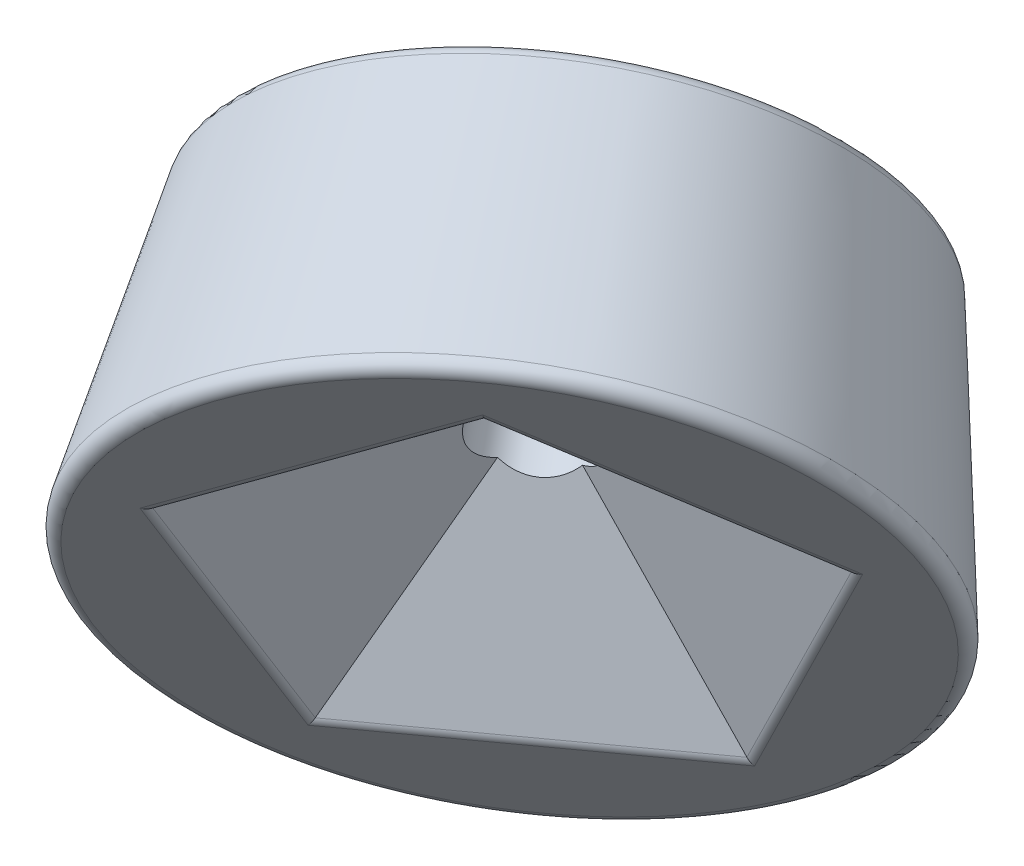
ISO-10303-21;
HEADER;
FILE_DESCRIPTION(('STEP AP214'),'2;1');
FILE_NAME('part.step','',(''),(''),'','','');
FILE_SCHEMA(('AUTOMOTIVE_DESIGN { 1 0 10303 214 1 1 1 1 }'));
ENDSEC;
DATA;
#1=APPLICATION_CONTEXT('core data for automotive mechanical design processes');
#2=APPLICATION_PROTOCOL_DEFINITION('international standard','automotive_design',2000,#1);
#3=PRODUCT_CONTEXT('',#1,'mechanical');
#4=PRODUCT('Part','Part','',(#3));
#5=PRODUCT_RELATED_PRODUCT_CATEGORY('part','',(#4));
#6=PRODUCT_DEFINITION_FORMATION('','',#4);
#7=PRODUCT_DEFINITION_CONTEXT('part definition',#1,'design');
#8=PRODUCT_DEFINITION('design','',#6,#7);
#9=PRODUCT_DEFINITION_SHAPE('','',#8);
#10=(LENGTH_UNIT() NAMED_UNIT(*) SI_UNIT(.MILLI.,.METRE.));
#11=(NAMED_UNIT(*) PLANE_ANGLE_UNIT() SI_UNIT($,.RADIAN.));
#12=(NAMED_UNIT(*) SI_UNIT($,.STERADIAN.) SOLID_ANGLE_UNIT());
#13=UNCERTAINTY_MEASURE_WITH_UNIT(LENGTH_MEASURE(1.E-05),#10,'distance_accuracy_value','');
#14=(GEOMETRIC_REPRESENTATION_CONTEXT(3) GLOBAL_UNCERTAINTY_ASSIGNED_CONTEXT((#13)) GLOBAL_UNIT_ASSIGNED_CONTEXT((#10,
#11,#12)) REPRESENTATION_CONTEXT('',''));
#15=CARTESIAN_POINT('',(0.,0.,0.));
#16=DIRECTION('',(0.,0.,1.));
#17=DIRECTION('',(1.,0.,0.));
#18=AXIS2_PLACEMENT_3D('',#15,#16,#17);
#19=CARTESIAN_POINT('',(-12.9243592330174,10.9941166289986,-17.788854382));
#20=DIRECTION('',(-0.52573111211913,0.447213595499961,-0.723606797749979));
#21=DIRECTION('',(-0.809016994374949,0.,0.587785252292471));
#22=AXIS2_PLACEMENT_3D('',#19,#20,#21);
#23=PLANE('',#22);
#24=DIRECTION('',(0.809016994374949,0.525731112119135,-0.262865556059561));
#25=VECTOR('',#24,1.);
#26=CARTESIAN_POINT('',(-16.9503146074278,22.0766210089228,-8.01446219937631));
#27=LINE('',#26,#25);
#28=CARTESIAN_POINT('',(-16.4420593360385,22.4069053056999,-8.17960434776489));
#29=VERTEX_POINT('',#28);
#30=CARTESIAN_POINT('',(-7.94800471586553,27.9266765996446,-10.9394899947371));
#31=VERTEX_POINT('',#30);
#32=EDGE_CURVE('E258',#29,#31,#27,.T.);
#33=ORIENTED_EDGE('',*,*,#32,.T.);
#34=DIRECTION('',(0.499999999999995,-0.525731112119139,-0.688190960235586));
#35=VECTOR('',#34,1.);
#36=CARTESIAN_POINT('',(-2.38427122562076,22.0766210089227,-18.5973121810301));
#37=LINE('',#36,#35);
#38=CARTESIAN_POINT('',(-2.69839025830066,22.4069053056999,-18.1649644235736));
#39=VERTEX_POINT('',#38);
#40=EDGE_CURVE('E264',#31,#39,#37,.T.);
#41=ORIENTED_EDGE('',*,*,#40,.T.);
#42=DIRECTION('',(-0.499999999999999,-0.850650808352039,-0.16245984811646));
#43=VECTOR('',#42,1.);
#44=CARTESIAN_POINT('',(-7.89885248454272,13.5593505125858,-19.8546970303949));
#45=LINE('',#44,#43);
#46=CARTESIAN_POINT('',(-7.94800471586544,13.4757277419719,-19.8706675584655));
#47=VERTEX_POINT('',#46);
#48=EDGE_CURVE('E261',#39,#47,#45,.T.);
#49=ORIENTED_EDGE('',*,*,#48,.T.);
#50=DIRECTION('',(-0.809016994374952,0.,0.587785252292467));
#51=VECTOR('',#50,1.);
#52=CARTESIAN_POINT('',(-16.3625293551352,13.4757277419717,-13.7571575550871));
#53=LINE('',#52,#51);
#54=CARTESIAN_POINT('',(-16.4420593360384,13.4757277419717,-13.6993756417095));
#55=VERTEX_POINT('',#54);
#56=EDGE_CURVE('E255',#47,#55,#53,.T.);
#57=ORIENTED_EDGE('',*,*,#56,.T.);
#58=DIRECTION('',(0.,0.850650808352036,0.52573111211914));
#59=VECTOR('',#58,1.);
#60=CARTESIAN_POINT('',(-16.4420593360385,22.3232825350859,-8.23128606223779));
#61=LINE('',#60,#59);
#62=EDGE_CURVE('E252',#55,#29,#61,.T.);
#63=ORIENTED_EDGE('',*,*,#62,.T.);
#64=EDGE_LOOP('',(#33,#41,#49,#57,#63));
#65=FACE_BOUND('',#64,.T.);
#66=CARTESIAN_POINT('',(-10.2957036724217,19.9383885389976,-14.1708203932502));
#67=DIRECTION('',(-0.52573111211913,0.447213595499961,-0.723606797749979));
#68=DIRECTION('',(-0.809016994374949,0.,0.587785252292471));
#69=AXIS2_PLACEMENT_3D('',#66,#67,#68);
#70=CIRCLE('',#69,10.5232985629623);
#71=CARTESIAN_POINT('',(-18.8092310467396,19.9383885389976,-7.98538069247037));
#72=VERTEX_POINT('',#71);
#73=EDGE_CURVE('E248',#72,#72,#70,.F.);
#74=ORIENTED_EDGE('',*,*,#73,.T.);
#75=EDGE_LOOP('',(#74));
#76=FACE_BOUND('',#75,.T.);
#77=ADVANCED_FACE('F137',(#65,#76),#23,.F.);
#78=CARTESIAN_POINT('',(-16.5993218992185,22.8470065541656,-5.39344662916647));
#79=DIRECTION('',(-0.577350269189626,0.794654472291765,-0.187592474085085));
#80=DIRECTION('',(-0.809016994374947,-0.587785252292474,0.));
#81=AXIS2_PLACEMENT_3D('',#78,#79,#80);
#82=PLANE('',#81);
#83=DIRECTION('',(-0.309016994374956,0.,0.951056516295151));
#84=VECTOR('',#83,1.);
#85=CARTESIAN_POINT('',(-13.1432778029782,22.3606797749979,-18.0901699437496));
#86=LINE('',#85,#84);
#87=CARTESIAN_POINT('',(-13.7608389517827,22.3606797749979,-16.1895121628748));
#88=VERTEX_POINT('',#87);
#89=CARTESIAN_POINT('',(-16.278682837301,22.3606797749979,-8.44038548723812));
#90=VERTEX_POINT('',#89);
#91=EDGE_CURVE('E229',#88,#90,#86,.T.);
#92=ORIENTED_EDGE('',*,*,#91,.F.);
#93=CARTESIAN_POINT('',(-13.1432778029782,22.3606797749979,-18.0901699437496));
#94=DIRECTION('',(-0.577350269189626,0.794654472291765,-0.187592474085085));
#95=DIRECTION('',(-0.11026408970826,-0.303530999103345,-0.946419971843438));
#96=AXIS2_PLACEMENT_3D('',#93,#94,#95);
#97=ELLIPSE('',#96,2.13929457302018,1.7);
#98=CARTESIAN_POINT('',(-12.144042874081,23.4113375558727,-16.7148410533122));
#99=VERTEX_POINT('',#98);
#100=EDGE_CURVE('E156',#88,#99,#97,.T.);
#101=ORIENTED_EDGE('',*,*,#100,.T.);
#102=DIRECTION('',(-0.499999999999993,-0.525731112119135,-0.68819096023559));
#103=VECTOR('',#102,1.);
#104=CARTESIAN_POINT('',(0.,36.180339887499,0.));
#105=LINE('',#104,#103);
#106=CARTESIAN_POINT('',(-8.07008588894658,27.6949494289132,-11.1075203141958));
#107=VERTEX_POINT('',#106);
#108=EDGE_CURVE('E240',#107,#99,#105,.T.);
#109=ORIENTED_EDGE('',*,*,#108,.F.);
#110=DIRECTION('',(0.809016994374949,0.525731112119135,-0.262865556059561));
#111=VECTOR('',#110,1.);
#112=CARTESIAN_POINT('',(-16.9296669445996,21.9376446582061,-8.22886792884227));
#113=LINE('',#112,#111);
#114=EDGE_CURVE('E385',#107,#90,#113,.F.);
#115=ORIENTED_EDGE('',*,*,#114,.T.);
#116=EDGE_LOOP('',(#92,#101,#109,#115));
#117=FACE_BOUND('',#116,.T.);
#118=ADVANCED_FACE('F317',(#117),#82,.F.);
#119=CARTESIAN_POINT('',(2.06681201188747E-13,22.8470065541656,-17.4535599249993));
#120=DIRECTION('',(0.,0.794654472291765,-0.607061998206687));
#121=DIRECTION('',(0.,0.607061998206687,0.794654472291765));
#122=AXIS2_PLACEMENT_3D('',#119,#120,#121);
#123=PLANE('',#122);
#124=ORIENTED_EDGE('',*,*,#108,.T.);
#125=CARTESIAN_POINT('',(-13.1432778029782,22.3606797749979,-18.0901699437496));
#126=DIRECTION('',(0.,0.794654472291765,-0.607061998206687));
#127=DIRECTION('',(-0.866025403784443,-0.303530999103335,-0.397327236145881));
#128=AXIS2_PLACEMENT_3D('',#125,#126,#127);
#129=ELLIPSE('',#128,2.13929457302019,1.7);
#130=CARTESIAN_POINT('',(-11.1448079451838,22.3606797749979,-18.0901699437496));
#131=VERTEX_POINT('',#130);
#132=EDGE_CURVE('E281',#99,#131,#129,.T.);
#133=ORIENTED_EDGE('',*,*,#132,.T.);
#134=DIRECTION('',(-1.,0.,0.));
#135=VECTOR('',#134,1.);
#136=CARTESIAN_POINT('',(13.1432778029785,22.3606797749979,-18.0901699437493));
#137=LINE('',#136,#135);
#138=CARTESIAN_POINT('',(-2.99689397491491,22.3606797749979,-18.0901699437495));
#139=VERTEX_POINT('',#138);
#140=EDGE_CURVE('E223',#139,#131,#137,.T.);
#141=ORIENTED_EDGE('',*,*,#140,.F.);
#142=DIRECTION('',(0.499999999999994,-0.525731112119139,-0.688190960235586));
#143=VECTOR('',#142,1.);
#144=CARTESIAN_POINT('',(-2.59456367046841,21.937644658206,-18.6439301008474));
#145=LINE('',#144,#143);
#146=EDGE_CURVE('E268',#139,#107,#145,.F.);
#147=ORIENTED_EDGE('',*,*,#146,.T.);
#148=EDGE_LOOP('',(#124,#133,#141,#147));
#149=FACE_BOUND('',#148,.T.);
#150=ADVANCED_FACE('F323',(#149),#123,.F.);
#151=CARTESIAN_POINT('',(2.52685582398812E-13,4.120226591666,-21.5737865166653));
#152=DIRECTION('',(0.,-0.187592474085081,0.982246946376846));
#153=DIRECTION('',(0.,-0.982246946376846,-0.187592474085081));
#154=AXIS2_PLACEMENT_3D('',#151,#152,#153);
#155=PLANE('',#154);
#156=CARTESIAN_POINT('',(-13.1432778029782,22.3606797749979,-18.0901699437497));
#157=DIRECTION('',(0.,-0.187592474085081,0.982246946376846));
#158=DIRECTION('',(-0.866025403784439,0.491123473188424,0.0937962370425304));
#159=AXIS2_PLACEMENT_3D('',#156,#157,#158);
#160=ELLIPSE('',#159,2.13929457302021,1.7);
#161=CARTESIAN_POINT('',(-12.1440428740809,20.6606797749979,-18.4148410533122));
#162=VERTEX_POINT('',#161);
#163=EDGE_CURVE('E213',#162,#131,#160,.T.);
#164=ORIENTED_EDGE('',*,*,#163,.F.);
#165=DIRECTION('',(0.500000000000002,-0.85065080835204,-0.162459848116448));
#166=VECTOR('',#165,1.);
#167=CARTESIAN_POINT('',(-13.1432778029781,22.3606797749979,-18.0901699437497));
#168=LINE('',#167,#166);
#169=CARTESIAN_POINT('',(-8.07008588894651,13.7296501698059,-19.738549919388));
#170=VERTEX_POINT('',#169);
#171=EDGE_CURVE('E141',#162,#170,#168,.T.);
#172=ORIENTED_EDGE('',*,*,#171,.T.);
#173=DIRECTION('',(-0.499999999999999,-0.850650808352039,-0.16245984811646));
#174=VECTOR('',#173,1.);
#175=CARTESIAN_POINT('',(-2.95783493447107,22.4271309836519,-18.0774788921934));
#176=LINE('',#175,#174);
#177=EDGE_CURVE('E375',#170,#139,#176,.F.);
#178=ORIENTED_EDGE('',*,*,#177,.T.);
#179=ORIENTED_EDGE('',*,*,#140,.T.);
#180=EDGE_LOOP('',(#164,#172,#178,#179));
#181=FACE_BOUND('',#180,.T.);
#182=ADVANCED_FACE('F330',(#181),#155,.T.);
#183=CARTESIAN_POINT('',(-10.2589451239174,-3.33333333333333,-14.1202265916661));
#184=DIRECTION('',(0.577350269189618,0.187592474085079,0.794654472291772));
#185=DIRECTION('',(0.809016994374953,0.,-0.587785252292465));
#186=AXIS2_PLACEMENT_3D('',#183,#184,#185);
#187=PLANE('',#186);
#188=CARTESIAN_POINT('',(-13.1432778029782,22.3606797749979,-18.0901699437496));
#189=DIRECTION('',(0.577350269189618,0.187592474085079,0.794654472291772));
#190=DIRECTION('',(-0.110264089708275,0.982246946376846,-0.151765499551666));
#191=AXIS2_PLACEMENT_3D('',#188,#189,#190);
#192=ELLIPSE('',#191,2.1392945730202,1.7);
#193=CARTESIAN_POINT('',(-13.7608389517827,20.6606797749979,-17.2401699437496));
#194=VERTEX_POINT('',#193);
#195=EDGE_CURVE('E203',#194,#162,#192,.T.);
#196=ORIENTED_EDGE('',*,*,#195,.F.);
#197=DIRECTION('',(-0.309016994374952,-0.85065080835204,0.425325404176017));
#198=VECTOR('',#197,1.);
#199=CARTESIAN_POINT('',(-13.1432778029782,22.3606797749979,-18.0901699437496));
#200=LINE('',#199,#198);
#201=CARTESIAN_POINT('',(-16.2786828373009,13.7296501698057,-13.7746551411536));
#202=VERTEX_POINT('',#201);
#203=EDGE_CURVE('E164',#194,#202,#200,.T.);
#204=ORIENTED_EDGE('',*,*,#203,.T.);
#205=DIRECTION('',(-0.809016994374952,0.,0.587785252292467));
#206=VECTOR('',#205,1.);
#207=CARTESIAN_POINT('',(-8.00688703393422,13.7296501698059,-19.7844665752757));
#208=LINE('',#207,#206);
#209=EDGE_CURVE('E148',#202,#170,#208,.F.);
#210=ORIENTED_EDGE('',*,*,#209,.T.);
#211=ORIENTED_EDGE('',*,*,#171,.F.);
#212=EDGE_LOOP('',(#196,#204,#210,#211));
#213=FACE_BOUND('',#212,.T.);
#214=ADVANCED_FACE('F211',(#213),#187,.T.);
#215=CARTESIAN_POINT('',(-20.517890247835,4.120226591666,-6.66666666666688));
#216=DIRECTION('',(0.934172358962713,-0.187592474085081,0.303530999103352));
#217=DIRECTION('',(0.309016994374956,0.,-0.951056516295151));
#218=AXIS2_PLACEMENT_3D('',#215,#216,#217);
#219=PLANE('',#218);
#220=CARTESIAN_POINT('',(-13.1432778029782,22.3606797749979,-18.0901699437496));
#221=DIRECTION('',(0.934172358962713,-0.187592474085081,0.303530999103352));
#222=DIRECTION('',(0.356822089773098,0.49112347318843,-0.794654472291758));
#223=AXIS2_PLACEMENT_3D('',#220,#221,#222);
#224=ELLIPSE('',#223,2.13929457302018,1.7);
#225=EDGE_CURVE('E201',#88,#194,#224,.T.);
#226=ORIENTED_EDGE('',*,*,#225,.F.);
#227=ORIENTED_EDGE('',*,*,#91,.T.);
#228=DIRECTION('',(0.,0.850650808352036,0.52573111211914));
#229=VECTOR('',#228,1.);
#230=CARTESIAN_POINT('',(-16.278682837301,13.6631989611517,-13.8157242466952));
#231=LINE('',#230,#229);
#232=EDGE_CURVE('E14',#90,#202,#231,.F.);
#233=ORIENTED_EDGE('',*,*,#232,.T.);
#234=ORIENTED_EDGE('',*,*,#203,.F.);
#235=EDGE_LOOP('',(#226,#227,#233,#234));
#236=FACE_BOUND('',#235,.T.);
#237=ADVANCED_FACE('F215',(#236),#219,.T.);
#238=CARTESIAN_POINT('',(-19.0211303259029,27.3606797749979,-26.1803398874991));
#239=DIRECTION('',(0.525731112119131,-0.447213595499962,0.723606797749978));
#240=DIRECTION('',(0.809016994374949,0.,-0.587785252292472));
#241=AXIS2_PLACEMENT_3D('',#238,#239,#240);
#242=CONICAL_SURFACE('',#241,8.07354557922219,0.174532925199426);
#243=CARTESIAN_POINT('',(-15.1672369960462,24.0823622986528,-20.8759107848599));
#244=DIRECTION('',(-0.525731112119131,0.447213595499962,-0.723606797749978));
#245=DIRECTION('',(-0.809016994374949,0.,0.587785252292471));
#246=AXIS2_PLACEMENT_3D('',#243,#244,#245);
#247=CIRCLE('',#246,9.36611769291537);
#248=CARTESIAN_POINT('',(-22.7445853809306,24.0823622986528,-15.3706449337286));
#249=VERTEX_POINT('',#248);
#250=EDGE_CURVE('E239',#249,#249,#247,.F.);
#251=ORIENTED_EDGE('',*,*,#250,.T.);
#252=EDGE_LOOP('',(#251));
#253=FACE_BOUND('',#252,.T.);
#254=CARTESIAN_POINT('',(-10.5425130170942,20.1483371075522,-14.5105243130609));
#255=DIRECTION('',(-0.52573111211913,0.447213595499961,-0.723606797749979));
#256=DIRECTION('',(-0.809016994374949,0.,0.587785252292471));
#257=AXIS2_PLACEMENT_3D('',#254,#255,#256);
#258=CIRCLE('',#257,10.9172216641672);
#259=CARTESIAN_POINT('',(-19.3747308747638,20.1483371075522,-8.09354242285553));
#260=VERTEX_POINT('',#259);
#261=EDGE_CURVE('E235',#260,#260,#258,.T.);
#262=ORIENTED_EDGE('',*,*,#261,.T.);
#263=EDGE_LOOP('',(#262));
#264=FACE_BOUND('',#263,.T.);
#265=ADVANCED_FACE('F296',(#253,#264),#242,.T.);
#266=CARTESIAN_POINT('',(-17.9696681016647,15.2859126964992,-24.733126291999));
#267=DIRECTION('',(0.525731112119131,-0.447213595499962,0.723606797749978));
#268=DIRECTION('',(0.809016994374949,0.,-0.587785252292471));
#269=AXIS2_PLACEMENT_3D('',#266,#267,#268);
#270=PLANE('',#269);
#271=CARTESIAN_POINT('',(-15.3410125410689,24.2301846064982,-21.1150923032492));
#272=DIRECTION('',(-0.525731112119131,0.447213595499962,-0.723606797749979));
#273=DIRECTION('',(-0.809016994374949,0.,0.587785252292471));
#274=AXIS2_PLACEMENT_3D('',#271,#272,#273);
#275=CIRCLE('',#274,1.7);
#276=CARTESIAN_POINT('',(-16.7163414315063,24.2301846064982,-20.115857374352));
#277=VERTEX_POINT('',#276);
#278=EDGE_CURVE('E208',#277,#277,#275,.T.);
#279=ORIENTED_EDGE('',*,*,#278,.F.);
#280=EDGE_LOOP('',(#279));
#281=FACE_BOUND('',#280,.T.);
#282=CARTESIAN_POINT('',(-15.3410125410689,24.2301846064982,-21.1150923032492));
#283=DIRECTION('',(0.525731112119131,-0.447213595499962,0.723606797749978));
#284=DIRECTION('',(0.809016994374949,0.,-0.587785252292471));
#285=AXIS2_PLACEMENT_3D('',#282,#283,#284);
#286=CIRCLE('',#285,8.97219459171049);
#287=CARTESIAN_POINT('',(-8.08235463953614,24.2301846064982,-26.3888159649549));
#288=VERTEX_POINT('',#287);
#289=EDGE_CURVE('E244',#288,#288,#286,.F.);
#290=ORIENTED_EDGE('',*,*,#289,.T.);
#291=EDGE_LOOP('',(#290));
#292=FACE_BOUND('',#291,.T.);
#293=ADVANCED_FACE('F292',(#281,#292),#270,.F.);
#294=CARTESIAN_POINT('',(-15.1307200962213,24.0512991682982,-20.8256495841492));
#295=DIRECTION('',(0.525731112119131,-0.447213595499962,0.723606797749978));
#296=DIRECTION('',(0.809016994374949,0.,-0.587785252292471));
#297=AXIS2_PLACEMENT_3D('',#294,#295,#296);
#298=TOROIDAL_SURFACE('',#297,8.97219459171049,0.4);
#299=ORIENTED_EDGE('',*,*,#289,.F.);
#300=EDGE_LOOP('',(#299));
#301=FACE_BOUND('',#300,.T.);
#302=ORIENTED_EDGE('',*,*,#250,.F.);
#303=EDGE_LOOP('',(#302));
#304=FACE_BOUND('',#303,.T.);
#305=ADVANCED_FACE('F295',(#301,#304),#298,.T.);
#306=CARTESIAN_POINT('',(-16.652351780886,10.0300320182865,-16.2289327138372));
#307=DIRECTION('',(0.,-0.850650808352036,-0.52573111211914));
#308=DIRECTION('',(0.,0.52573111211914,-0.850650808352036));
#309=AXIS2_PLACEMENT_3D('',#306,#307,#308);
#310=CYLINDRICAL_SURFACE('',#309,0.4);
#311=CARTESIAN_POINT('',(-16.6523517808861,22.5857907438999,-8.46904706686488));
#312=DIRECTION('',(0.499999999999998,0.85065080835204,0.162459848116461));
#313=DIRECTION('',(0.688190960235591,-0.276393202250016,-0.670820393249935));
#314=AXIS2_PLACEMENT_3D('',#311,#312,#313);
#315=ELLIPSE('',#314,0.494427190999917,0.4);
#316=EDGE_CURVE('E225',#29,#90,#315,.T.);
#317=ORIENTED_EDGE('',*,*,#316,.F.);
#318=ORIENTED_EDGE('',*,*,#62,.F.);
#319=CARTESIAN_POINT('',(-16.6523517808861,13.6546131801717,-13.9888183608095));
#320=DIRECTION('',(0.500000000000008,-0.525731112119126,-0.688190960235587));
#321=DIRECTION('',(0.688190960235584,0.723606797749983,-0.0527864045000309));
#322=AXIS2_PLACEMENT_3D('',#319,#320,#321);
#323=ELLIPSE('',#322,0.494427190999916,0.4);
#324=EDGE_CURVE('E219',#202,#55,#323,.T.);
#325=ORIENTED_EDGE('',*,*,#324,.F.);
#326=ORIENTED_EDGE('',*,*,#232,.F.);
#327=EDGE_LOOP('',(#317,#318,#325,#326));
#328=FACE_BOUND('',#327,.T.);
#329=ADVANCED_FACE('F302',(#328),#310,.T.);
#330=CARTESIAN_POINT('',(-12.4053244707997,13.6546131801718,-17.0744643191874));
#331=DIRECTION('',(0.809016994374952,0.,-0.587785252292467));
#332=DIRECTION('',(-0.587785252292467,0.,-0.809016994374952));
#333=AXIS2_PLACEMENT_3D('',#330,#331,#332);
#334=CYLINDRICAL_SURFACE('',#333,0.4);
#335=ORIENTED_EDGE('',*,*,#324,.T.);
#336=ORIENTED_EDGE('',*,*,#56,.F.);
#337=CARTESIAN_POINT('',(-8.15829716071309,13.6546131801718,-20.1601102775655));
#338=DIRECTION('',(0.809016994374948,0.525731112119138,-0.262865556059558));
#339=DIRECTION('',(-0.262865556059573,0.723606797749974,0.638196601125014));
#340=AXIS2_PLACEMENT_3D('',#337,#338,#339);
#341=ELLIPSE('',#340,0.494427190999915,0.4);
#342=EDGE_CURVE('E363',#170,#47,#341,.T.);
#343=ORIENTED_EDGE('',*,*,#342,.F.);
#344=ORIENTED_EDGE('',*,*,#209,.F.);
#345=EDGE_LOOP('',(#335,#336,#343,#344));
#346=FACE_BOUND('',#345,.T.);
#347=ADVANCED_FACE('F349',(#346),#334,.T.);
#348=CARTESIAN_POINT('',(-17.1606070522754,22.2555064471228,-8.3039049184763));
#349=DIRECTION('',(0.809016994374949,0.525731112119135,-0.262865556059561));
#350=DIRECTION('',(-0.544893675596392,0.838505147446964,0.));
#351=AXIS2_PLACEMENT_3D('',#348,#349,#350);
#352=CYLINDRICAL_SURFACE('',#351,0.4);
#353=ORIENTED_EDGE('',*,*,#316,.T.);
#354=ORIENTED_EDGE('',*,*,#114,.F.);
#355=CARTESIAN_POINT('',(-8.15829716071318,28.1055620378446,-11.2289327138371));
#356=DIRECTION('',(0.809016994374948,0.,-0.587785252292472));
#357=DIRECTION('',(-0.26286555605957,-0.894427190999914,-0.361803398874991));
#358=AXIS2_PLACEMENT_3D('',#355,#356,#357);
#359=ELLIPSE('',#358,0.494427190999918,0.4);
#360=EDGE_CURVE('E366',#31,#107,#359,.T.);
#361=ORIENTED_EDGE('',*,*,#360,.F.);
#362=ORIENTED_EDGE('',*,*,#32,.F.);
#363=EDGE_LOOP('',(#353,#354,#361,#362));
#364=FACE_BOUND('',#363,.T.);
#365=ADVANCED_FACE('F345',(#364),#352,.T.);
#366=CARTESIAN_POINT('',(-10.2887725134064,10.0300320182865,-20.8523436819943));
#367=DIRECTION('',(0.499999999999999,0.850650808352039,0.16245984811646));
#368=DIRECTION('',(-0.862103722396976,0.506731853971386,0.));
#369=AXIS2_PLACEMENT_3D('',#366,#367,#368);
#370=CYLINDRICAL_SURFACE('',#369,0.4);
#371=ORIENTED_EDGE('',*,*,#342,.T.);
#372=ORIENTED_EDGE('',*,*,#48,.F.);
#373=CARTESIAN_POINT('',(-2.90868270314831,22.5857907438999,-18.4544071426736));
#374=DIRECTION('',(0.,-0.850650808352039,-0.525731112119135));
#375=DIRECTION('',(0.850650808352042,0.276393202250018,-0.447213595499956));
#376=AXIS2_PLACEMENT_3D('',#373,#374,#375);
#377=ELLIPSE('',#376,0.494427190999914,0.4);
#378=EDGE_CURVE('E280',#139,#39,#377,.F.);
#379=ORIENTED_EDGE('',*,*,#378,.F.);
#380=ORIENTED_EDGE('',*,*,#177,.F.);
#381=EDGE_LOOP('',(#371,#372,#379,#380));
#382=FACE_BOUND('',#381,.T.);
#383=ADVANCED_FACE('F341',(#382),#370,.T.);
#384=CARTESIAN_POINT('',(-2.59456367046841,22.2555064471227,-18.8867549001301));
#385=DIRECTION('',(0.499999999999994,-0.525731112119139,-0.688190960235586));
#386=DIRECTION('',(0.,0.794654472291763,-0.607061998206691));
#387=AXIS2_PLACEMENT_3D('',#384,#385,#386);
#388=CYLINDRICAL_SURFACE('',#387,0.4);
#389=ORIENTED_EDGE('',*,*,#360,.T.);
#390=ORIENTED_EDGE('',*,*,#146,.F.);
#391=ORIENTED_EDGE('',*,*,#378,.T.);
#392=ORIENTED_EDGE('',*,*,#40,.F.);
#393=EDGE_LOOP('',(#389,#390,#391,#392));
#394=FACE_BOUND('',#393,.T.);
#395=ADVANCED_FACE('F313',(#394),#388,.T.);
#396=CARTESIAN_POINT('',(-10.5059961172693,20.1172739771976,-14.4602631123501));
#397=DIRECTION('',(-0.52573111211913,0.447213595499961,-0.723606797749979));
#398=DIRECTION('',(-0.809016994374949,0.,0.587785252292471));
#399=AXIS2_PLACEMENT_3D('',#396,#397,#398);
#400=TOROIDAL_SURFACE('',#399,10.5232985629623,0.4);
#401=ORIENTED_EDGE('',*,*,#261,.F.);
#402=EDGE_LOOP('',(#401));
#403=FACE_BOUND('',#402,.T.);
#404=ORIENTED_EDGE('',*,*,#73,.F.);
#405=EDGE_LOOP('',(#404));
#406=FACE_BOUND('',#405,.T.);
#407=ADVANCED_FACE('F139',(#403,#406),#400,.T.);
#408=CARTESIAN_POINT('',(-2.69895019719884,13.4762040544481,-3.71478625567689));
#409=DIRECTION('',(-0.525731112119131,0.447213595499962,-0.723606797749979));
#410=DIRECTION('',(-0.809016994374949,0.,0.587785252292471));
#411=AXIS2_PLACEMENT_3D('',#408,#409,#410);
#412=CYLINDRICAL_SURFACE('',#411,1.7);
#413=ORIENTED_EDGE('',*,*,#278,.T.);
#414=EDGE_LOOP('',(#413));
#415=FACE_BOUND('',#414,.T.);
#416=ORIENTED_EDGE('',*,*,#225,.T.);
#417=ORIENTED_EDGE('',*,*,#195,.T.);
#418=ORIENTED_EDGE('',*,*,#163,.T.);
#419=ORIENTED_EDGE('',*,*,#132,.F.);
#420=ORIENTED_EDGE('',*,*,#100,.F.);
#421=EDGE_LOOP('',(#416,#417,#418,#419,#420));
#422=FACE_BOUND('',#421,.T.);
#423=ADVANCED_FACE('F202',(#415,#422),#412,.F.);
#424=CLOSED_SHELL('',(#77,#118,#150,#182,#214,#237,#265,#293,#305,#329,#347,#365,#383,#395,#407,#423));
#425=MANIFOLD_SOLID_BREP('B2',#424);
#426=ADVANCED_BREP_SHAPE_REPRESENTATION('',(#18,#425),#14);
#427=SHAPE_DEFINITION_REPRESENTATION(#9,#426);
ENDSEC;
END-ISO-10303-21;
